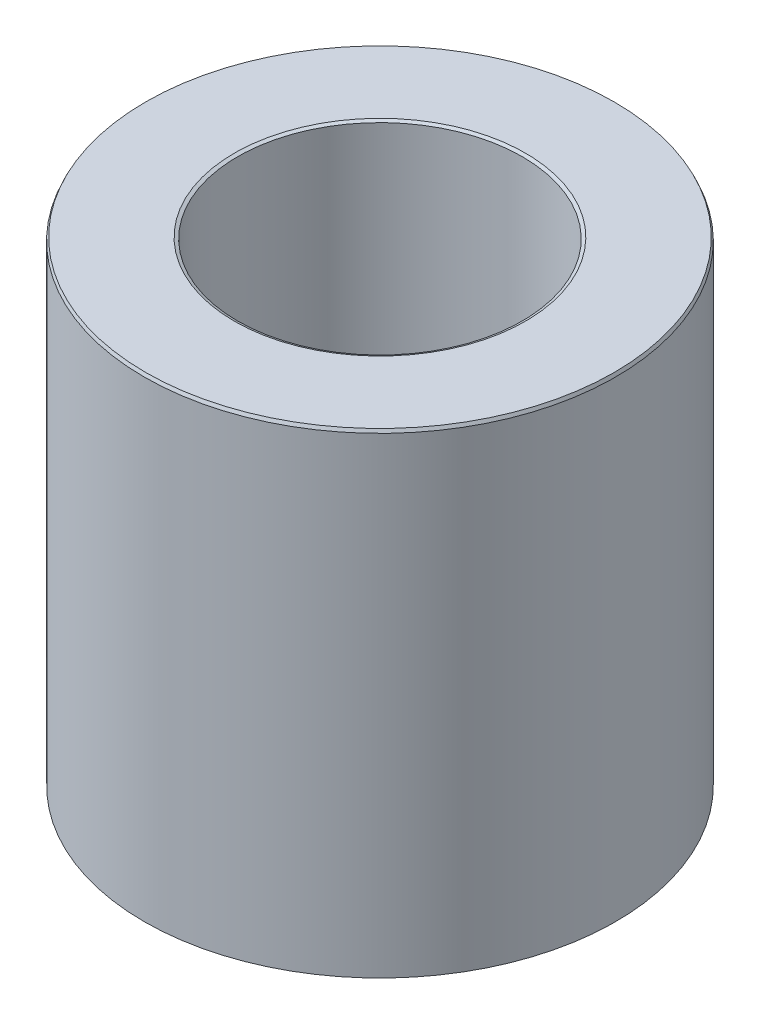
ISO-10303-21;
HEADER;
FILE_DESCRIPTION(('STEP AP214'),'2;1');
FILE_NAME('part.step','',(''),(''),'','','');
FILE_SCHEMA(('AUTOMOTIVE_DESIGN { 1 0 10303 214 1 1 1 1 }'));
ENDSEC;
DATA;
#1=APPLICATION_CONTEXT('core data for automotive mechanical design processes');
#2=APPLICATION_PROTOCOL_DEFINITION('international standard','automotive_design',2000,#1);
#3=PRODUCT_CONTEXT('',#1,'mechanical');
#4=PRODUCT('Part','Part','',(#3));
#5=PRODUCT_RELATED_PRODUCT_CATEGORY('part','',(#4));
#6=PRODUCT_DEFINITION_FORMATION('','',#4);
#7=PRODUCT_DEFINITION_CONTEXT('part definition',#1,'design');
#8=PRODUCT_DEFINITION('design','',#6,#7);
#9=PRODUCT_DEFINITION_SHAPE('','',#8);
#10=(LENGTH_UNIT() NAMED_UNIT(*) SI_UNIT(.MILLI.,.METRE.));
#11=(NAMED_UNIT(*) PLANE_ANGLE_UNIT() SI_UNIT($,.RADIAN.));
#12=(NAMED_UNIT(*) SI_UNIT($,.STERADIAN.) SOLID_ANGLE_UNIT());
#13=UNCERTAINTY_MEASURE_WITH_UNIT(LENGTH_MEASURE(1.E-05),#10,'distance_accuracy_value','');
#14=(GEOMETRIC_REPRESENTATION_CONTEXT(3) GLOBAL_UNCERTAINTY_ASSIGNED_CONTEXT((#13)) GLOBAL_UNIT_ASSIGNED_CONTEXT((#10,
#11,#12)) REPRESENTATION_CONTEXT('',''));
#15=CARTESIAN_POINT('',(0.,0.,0.));
#16=DIRECTION('',(0.,0.,1.));
#17=DIRECTION('',(1.,0.,0.));
#18=AXIS2_PLACEMENT_3D('',#15,#16,#17);
#19=CARTESIAN_POINT('',(0.,121.25159999943,0.));
#20=DIRECTION('',(0.,-1.,0.));
#21=DIRECTION('',(0.,0.,-1.));
#22=AXIS2_PLACEMENT_3D('',#19,#20,#21);
#23=CYLINDRICAL_SURFACE('',#22,60.);
#24=CARTESIAN_POINT('',(0.,0.363378662399508,0.));
#25=DIRECTION('',(0.,1.,0.));
#26=DIRECTION('',(0.,0.,1.));
#27=AXIS2_PLACEMENT_3D('',#24,#25,#26);
#28=CIRCLE('',#27,60.);
#29=CARTESIAN_POINT('',(0.,0.363378662399508,60.));
#30=VERTEX_POINT('',#29);
#31=EDGE_CURVE('E10',#30,#30,#28,.T.);
#32=ORIENTED_EDGE('',*,*,#31,.T.);
#33=EDGE_LOOP('',(#32));
#34=FACE_BOUND('',#33,.T.);
#35=CARTESIAN_POINT('',(0.,120.427982217533,0.));
#36=DIRECTION('',(0.,1.,0.));
#37=DIRECTION('',(0.,0.,1.));
#38=AXIS2_PLACEMENT_3D('',#35,#36,#37);
#39=CIRCLE('',#38,60.);
#40=CARTESIAN_POINT('',(0.,120.427982217533,60.));
#41=VERTEX_POINT('',#40);
#42=EDGE_CURVE('E50',#41,#41,#39,.F.);
#43=ORIENTED_EDGE('',*,*,#42,.T.);
#44=EDGE_LOOP('',(#43));
#45=FACE_BOUND('',#44,.T.);
#46=ADVANCED_FACE('F39',(#34,#45),#23,.T.);
#47=CARTESIAN_POINT('',(0.,121.25159999943,0.));
#48=DIRECTION('',(0.,1.,0.));
#49=DIRECTION('',(0.,0.,1.));
#50=AXIS2_PLACEMENT_3D('',#47,#48,#49);
#51=PLANE('',#50);
#52=CARTESIAN_POINT('',(0.,121.25159999943,0.));
#53=DIRECTION('',(0.,1.,0.));
#54=DIRECTION('',(0.,0.,1.));
#55=AXIS2_PLACEMENT_3D('',#52,#53,#54);
#56=CIRCLE('',#55,37.0563207179928);
#57=CARTESIAN_POINT('',(0.,121.25159999943,37.0563207179928));
#58=VERTEX_POINT('',#57);
#59=EDGE_CURVE('E58',#58,#58,#56,.F.);
#60=ORIENTED_EDGE('',*,*,#59,.T.);
#61=EDGE_LOOP('',(#60));
#62=FACE_BOUND('',#61,.T.);
#63=CARTESIAN_POINT('',(0.,121.25159999943,0.));
#64=DIRECTION('',(0.,1.,0.));
#65=DIRECTION('',(0.,0.,1.));
#66=AXIS2_PLACEMENT_3D('',#63,#64,#65);
#67=CIRCLE('',#66,59.6366213376005);
#68=CARTESIAN_POINT('',(0.,121.25159999943,59.6366213376005));
#69=VERTEX_POINT('',#68);
#70=EDGE_CURVE('E61',#69,#69,#67,.T.);
#71=ORIENTED_EDGE('',*,*,#70,.T.);
#72=EDGE_LOOP('',(#71));
#73=FACE_BOUND('',#72,.T.);
#74=ADVANCED_FACE('F88',(#62,#73),#51,.T.);
#75=CARTESIAN_POINT('',(0.,0.,0.));
#76=DIRECTION('',(0.,1.,0.));
#77=DIRECTION('',(0.,0.,1.));
#78=AXIS2_PLACEMENT_3D('',#75,#76,#77);
#79=PLANE('',#78);
#80=CARTESIAN_POINT('',(0.,0.,0.));
#81=DIRECTION('',(0.,1.,0.));
#82=DIRECTION('',(0.,0.,1.));
#83=AXIS2_PLACEMENT_3D('',#80,#81,#82);
#84=CIRCLE('',#83,36.596081598495);
#85=CARTESIAN_POINT('',(0.,0.,36.596081598495));
#86=VERTEX_POINT('',#85);
#87=EDGE_CURVE('E51',#86,#86,#84,.T.);
#88=ORIENTED_EDGE('',*,*,#87,.T.);
#89=EDGE_LOOP('',(#88));
#90=FACE_BOUND('',#89,.T.);
#91=CARTESIAN_POINT('',(0.,0.,0.));
#92=DIRECTION('',(0.,1.,0.));
#93=DIRECTION('',(0.,0.,1.));
#94=AXIS2_PLACEMENT_3D('',#91,#92,#93);
#95=CIRCLE('',#94,59.1763822181027);
#96=CARTESIAN_POINT('',(0.,0.,59.1763822181027));
#97=VERTEX_POINT('',#96);
#98=EDGE_CURVE('E54',#97,#97,#95,.F.);
#99=ORIENTED_EDGE('',*,*,#98,.T.);
#100=EDGE_LOOP('',(#99));
#101=FACE_BOUND('',#100,.T.);
#102=ADVANCED_FACE('F83',(#90,#101),#79,.F.);
#103=CARTESIAN_POINT('',(0.,121.25159999943,0.));
#104=DIRECTION('',(0.,-1.,0.));
#105=DIRECTION('',(0.,0.,-1.));
#106=AXIS2_PLACEMENT_3D('',#103,#104,#105);
#107=CYLINDRICAL_SURFACE('',#106,36.2327029360954);
#108=CARTESIAN_POINT('',(0.,120.888221337031,0.));
#109=DIRECTION('',(0.,1.,0.));
#110=DIRECTION('',(0.,0.,1.));
#111=AXIS2_PLACEMENT_3D('',#108,#109,#110);
#112=CIRCLE('',#111,36.2327029360954);
#113=CARTESIAN_POINT('',(0.,120.888221337031,36.2327029360954));
#114=VERTEX_POINT('',#113);
#115=EDGE_CURVE('E67',#114,#114,#112,.T.);
#116=ORIENTED_EDGE('',*,*,#115,.T.);
#117=EDGE_LOOP('',(#116));
#118=FACE_BOUND('',#117,.T.);
#119=CARTESIAN_POINT('',(0.,0.823617781897393,0.));
#120=DIRECTION('',(0.,1.,0.));
#121=DIRECTION('',(0.,0.,1.));
#122=AXIS2_PLACEMENT_3D('',#119,#120,#121);
#123=CIRCLE('',#122,36.2327029360954);
#124=CARTESIAN_POINT('',(0.,0.823617781897393,36.2327029360954));
#125=VERTEX_POINT('',#124);
#126=EDGE_CURVE('E69',#125,#125,#123,.F.);
#127=ORIENTED_EDGE('',*,*,#126,.T.);
#128=EDGE_LOOP('',(#127));
#129=FACE_BOUND('',#128,.T.);
#130=ADVANCED_FACE('F71',(#118,#129),#107,.F.);
#131=CARTESIAN_POINT('',(0.,120.888221337031,0.));
#132=DIRECTION('',(0.,1.,0.));
#133=DIRECTION('',(0.,0.,1.));
#134=AXIS2_PLACEMENT_3D('',#131,#132,#133);
#135=CONICAL_SURFACE('',#134,36.2327029360954,1.1552860626572);
#136=ORIENTED_EDGE('',*,*,#59,.F.);
#137=EDGE_LOOP('',(#136));
#138=FACE_BOUND('',#137,.T.);
#139=ORIENTED_EDGE('',*,*,#115,.F.);
#140=EDGE_LOOP('',(#139));
#141=FACE_BOUND('',#140,.T.);
#142=ADVANCED_FACE('F77',(#138,#141),#135,.F.);
#143=CARTESIAN_POINT('',(0.,0.,0.));
#144=DIRECTION('',(0.,-1.,0.));
#145=DIRECTION('',(0.,0.,-1.));
#146=AXIS2_PLACEMENT_3D('',#143,#144,#145);
#147=CONICAL_SURFACE('',#146,36.596081598495,0.415510264137688);
#148=ORIENTED_EDGE('',*,*,#126,.F.);
#149=EDGE_LOOP('',(#148));
#150=FACE_BOUND('',#149,.T.);
#151=ORIENTED_EDGE('',*,*,#87,.F.);
#152=EDGE_LOOP('',(#151));
#153=FACE_BOUND('',#152,.T.);
#154=ADVANCED_FACE('F73',(#150,#153),#147,.F.);
#155=CARTESIAN_POINT('',(0.,0.363378662399508,0.));
#156=DIRECTION('',(0.,1.,0.));
#157=DIRECTION('',(0.,0.,1.));
#158=AXIS2_PLACEMENT_3D('',#155,#156,#157);
#159=CONICAL_SURFACE('',#158,60.,1.15528606265723);
#160=CARTESIAN_POINT('',(0.,0.,59.1763822181027));
#161=CARTESIAN_POINT('',(0.,0.00378519439999623,59.1849615699974));
#162=CARTESIAN_POINT('',(0.,0.00757038879999061,59.1935409218922));
#163=CARTESIAN_POINT('',(0.,0.0151407775999794,59.2106996256817));
#164=CARTESIAN_POINT('',(0.,0.0189259719999737,59.2192789775765));
#165=CARTESIAN_POINT('',(0.,0.0264963607999638,59.236437681366));
#166=CARTESIAN_POINT('',(0.,0.0302815551999594,59.2450170332608));
#167=CARTESIAN_POINT('',(0.,0.0378519439999491,59.2621757370503));
#168=CARTESIAN_POINT('',(0.,0.0416371383999431,59.2707550889451));
#169=CARTESIAN_POINT('',(0.,0.0492075271999329,59.2879137927346));
#170=CARTESIAN_POINT('',(0.,0.0529927215999286,59.2964931446294));
#171=CARTESIAN_POINT('',(0.,0.0605631103999183,59.3136518484189));
#172=CARTESIAN_POINT('',(0.,0.0643483047999124,59.3222312003137));
#173=CARTESIAN_POINT('',(0.,0.0719186935999021,59.3393899041032));
#174=CARTESIAN_POINT('',(0.,0.0757038879998978,59.3479692559979));
#175=CARTESIAN_POINT('',(0.,0.0832742767998876,59.3651279597875));
#176=CARTESIAN_POINT('',(0.,0.0870594711998816,59.3737073116822));
#177=CARTESIAN_POINT('',(0.,0.0946298599998713,59.3908660154718));
#178=CARTESIAN_POINT('',(0.,0.0984150543998671,59.3994453673665));
#179=CARTESIAN_POINT('',(0.,0.105985443199857,59.4166040711561));
#180=CARTESIAN_POINT('',(0.,0.109770637599851,59.4251834230508));
#181=CARTESIAN_POINT('',(0.,0.117341026399841,59.4423421268404));
#182=CARTESIAN_POINT('',(0.,0.121126220799836,59.4509214787351));
#183=CARTESIAN_POINT('',(0.,0.128696609599826,59.4680801825246));
#184=CARTESIAN_POINT('',(0.,0.13248180399982,59.4766595344194));
#185=CARTESIAN_POINT('',(0.,0.14005219279981,59.4938182382089));
#186=CARTESIAN_POINT('',(0.,0.143837387199806,59.5023975901037));
#187=CARTESIAN_POINT('',(0.,0.151407775999795,59.5195562938932));
#188=CARTESIAN_POINT('',(0.,0.155192970399789,59.528135645788));
#189=CARTESIAN_POINT('',(0.,0.162763359199779,59.5452943495775));
#190=CARTESIAN_POINT('',(0.,0.166548553599775,59.5538737014723));
#191=CARTESIAN_POINT('',(0.,0.174118942399765,59.5710324052618));
#192=CARTESIAN_POINT('',(0.,0.177904136799759,59.5796117571566));
#193=CARTESIAN_POINT('',(0.,0.185474525599748,59.5967704609461));
#194=CARTESIAN_POINT('',(0.,0.189259719999744,59.6053498128409));
#195=CARTESIAN_POINT('',(0.,0.196830108799734,59.6225085166304));
#196=CARTESIAN_POINT('',(0.,0.200615303199728,59.6310878685252));
#197=CARTESIAN_POINT('',(0.,0.208185691999718,59.6482465723147));
#198=CARTESIAN_POINT('',(0.,0.211970886399713,59.6568259242094));
#199=CARTESIAN_POINT('',(0.,0.219541275199703,59.673984627999));
#200=CARTESIAN_POINT('',(0.,0.223326469599697,59.6825639798937));
#201=CARTESIAN_POINT('',(0.,0.230896858399687,59.6997226836833));
#202=CARTESIAN_POINT('',(0.,0.234682052799682,59.708302035578));
#203=CARTESIAN_POINT('',(0.,0.242252441599672,59.7254607393676));
#204=CARTESIAN_POINT('',(0.,0.246037635999666,59.7340400912623));
#205=CARTESIAN_POINT('',(0.,0.253608024799656,59.7511987950518));
#206=CARTESIAN_POINT('',(0.,0.257393219199652,59.7597781469466));
#207=CARTESIAN_POINT('',(0.,0.264963607999641,59.7769368507361));
#208=CARTESIAN_POINT('',(0.,0.268748802399636,59.7855162026309));
#209=CARTESIAN_POINT('',(0.,0.276319191199625,59.8026749064204));
#210=CARTESIAN_POINT('',(0.,0.280104385599621,59.8112542583152));
#211=CARTESIAN_POINT('',(0.,0.287674774399611,59.8284129621047));
#212=CARTESIAN_POINT('',(0.,0.291459968799605,59.8369923139995));
#213=CARTESIAN_POINT('',(0.,0.299030357599594,59.854151017789));
#214=CARTESIAN_POINT('',(0.,0.30281555199959,59.8627303696838));
#215=CARTESIAN_POINT('',(0.,0.31038594079958,59.8798890734733));
#216=CARTESIAN_POINT('',(0.,0.314171135199574,59.8884684253681));
#217=CARTESIAN_POINT('',(0.,0.321741523999564,59.9056271291576));
#218=CARTESIAN_POINT('',(0.,0.325526718399559,59.9142064810524));
#219=CARTESIAN_POINT('',(0.,0.333097107199549,59.9313651848419));
#220=CARTESIAN_POINT('',(0.,0.336882301599543,59.9399445367366));
#221=CARTESIAN_POINT('',(0.,0.344452690399533,59.9571032405262));
#222=CARTESIAN_POINT('',(0.,0.348237884799528,59.9656825924209));
#223=CARTESIAN_POINT('',(0.,0.355808273599519,59.9828412962105));
#224=CARTESIAN_POINT('',(0.,0.359593467999514,59.9914206481052));
#225=CARTESIAN_POINT('',(0.,0.363378662399508,60.));
#226=B_SPLINE_CURVE_WITH_KNOTS('',3,(#160,#161,#162,#163,#164,#165,#166,#167,#168,#169,#170,
#171,#172,#173,#174,#175,#176,#177,#178,#179,#180,#181,#182,#183,#184,#185,#186,#187,#188,#189,
#190,#191,#192,#193,#194,#195,#196,#197,#198,#199,#200,#201,#202,#203,#204,#205,#206,#207,#208,
#209,#210,#211,#212,#213,#214,#215,#216,#217,#218,#219,#220,#221,#222,#223,#224,#225),
.UNSPECIFIED.,.F.,.F.,(4,2,2,2,2,2,2,2,2,2,2,2,2,2,2,2,2,2,2,2,2,2,2,2,2,2,2,2,2,2,2,2,4),(0.,
0.0281317752767094,0.0562635505534251,0.0843953258301345,0.11252710110685,0.14065887638356,
0.168790651660275,0.196922426936985,0.2250542022137,0.25318597749041,0.281317752767126,
0.309449528043835,0.337581303320551,0.36571307859726,0.393844853873976,0.421976629150685,
0.450108404427401,0.47824017970411,0.506371954980826,0.534503730257535,0.562635505534251,
0.590767280810961,0.618899056087676,0.647030831364386,0.675162606641101,0.703294381917811,
0.731426157194526,0.759557932471236,0.787689707747951,0.815821483024661,0.843953258301377,
0.872085033578086,0.900216808854802),.UNSPECIFIED.);
#227=EDGE_CURVE('BSEAM76',#97,#30,#226,.T.);
#228=ORIENTED_EDGE('',*,*,#98,.F.);
#229=ORIENTED_EDGE('',*,*,#31,.F.);
#230=ORIENTED_EDGE('',*,*,#227,.T.);
#231=ORIENTED_EDGE('',*,*,#227,.F.);
#232=EDGE_LOOP('',(#228,#230,#229,#231));
#233=FACE_BOUND('',#232,.T.);
#234=ADVANCED_FACE('F76',(#233),#159,.T.);
#235=CARTESIAN_POINT('',(0.,121.25159999943,0.));
#236=DIRECTION('',(0.,-1.,0.));
#237=DIRECTION('',(0.,0.,-1.));
#238=AXIS2_PLACEMENT_3D('',#235,#236,#237);
#239=CONICAL_SURFACE('',#238,59.6366213376005,0.415510264137679);
#240=ORIENTED_EDGE('',*,*,#42,.F.);
#241=EDGE_LOOP('',(#240));
#242=FACE_BOUND('',#241,.T.);
#243=ORIENTED_EDGE('',*,*,#70,.F.);
#244=EDGE_LOOP('',(#243));
#245=FACE_BOUND('',#244,.T.);
#246=ADVANCED_FACE('F45',(#242,#245),#239,.T.);
#247=CLOSED_SHELL('',(#46,#74,#102,#130,#142,#154,#234,#246));
#248=MANIFOLD_SOLID_BREP('B2',#247);
#249=ADVANCED_BREP_SHAPE_REPRESENTATION('',(#18,#248),#14);
#250=SHAPE_DEFINITION_REPRESENTATION(#9,#249);
ENDSEC;
END-ISO-10303-21;
